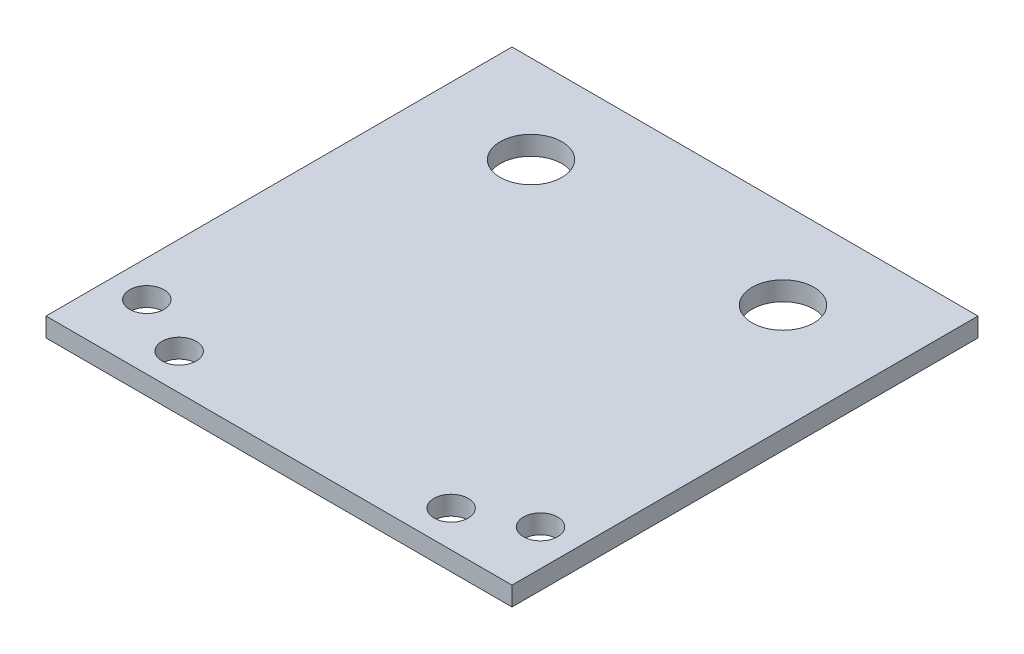
ISO-10303-21;
HEADER;
FILE_DESCRIPTION(('STEP AP214'),'2;1');
FILE_NAME('part.step','',(''),(''),'','','');
FILE_SCHEMA(('AUTOMOTIVE_DESIGN { 1 0 10303 214 1 1 1 1 }'));
ENDSEC;
DATA;
#1=APPLICATION_CONTEXT('core data for automotive mechanical design processes');
#2=APPLICATION_PROTOCOL_DEFINITION('international standard','automotive_design',2000,#1);
#3=PRODUCT_CONTEXT('',#1,'mechanical');
#4=PRODUCT('Part','Part','',(#3));
#5=PRODUCT_RELATED_PRODUCT_CATEGORY('part','',(#4));
#6=PRODUCT_DEFINITION_FORMATION('','',#4);
#7=PRODUCT_DEFINITION_CONTEXT('part definition',#1,'design');
#8=PRODUCT_DEFINITION('design','',#6,#7);
#9=PRODUCT_DEFINITION_SHAPE('','',#8);
#10=(LENGTH_UNIT() NAMED_UNIT(*) SI_UNIT(.MILLI.,.METRE.));
#11=(NAMED_UNIT(*) PLANE_ANGLE_UNIT() SI_UNIT($,.RADIAN.));
#12=(NAMED_UNIT(*) SI_UNIT($,.STERADIAN.) SOLID_ANGLE_UNIT());
#13=UNCERTAINTY_MEASURE_WITH_UNIT(LENGTH_MEASURE(1.E-05),#10,'distance_accuracy_value','');
#14=(GEOMETRIC_REPRESENTATION_CONTEXT(3) GLOBAL_UNCERTAINTY_ASSIGNED_CONTEXT((#13)) GLOBAL_UNIT_ASSIGNED_CONTEXT((#10,
#11,#12)) REPRESENTATION_CONTEXT('',''));
#15=CARTESIAN_POINT('',(0.,0.,0.));
#16=DIRECTION('',(0.,0.,1.));
#17=DIRECTION('',(1.,0.,0.));
#18=AXIS2_PLACEMENT_3D('',#15,#16,#17);
#19=CARTESIAN_POINT('',(0.,5.,0.));
#20=DIRECTION('',(0.,-1.,0.));
#21=DIRECTION('',(0.,0.,-1.));
#22=AXIS2_PLACEMENT_3D('',#19,#20,#21);
#23=PLANE('',#22);
#24=CARTESIAN_POINT('',(103.5,5.,88.5));
#25=DIRECTION('',(0.,1.,0.));
#26=DIRECTION('',(0.,0.,1.));
#27=AXIS2_PLACEMENT_3D('',#24,#25,#26);
#28=CIRCLE('',#27,8.99999999999999);
#29=CARTESIAN_POINT('',(103.5,5.,97.5));
#30=VERTEX_POINT('',#29);
#31=EDGE_CURVE('E167',#30,#30,#28,.T.);
#32=ORIENTED_EDGE('',*,*,#31,.F.);
#33=EDGE_LOOP('',(#32));
#34=FACE_BOUND('',#33,.T.);
#35=CARTESIAN_POINT('',(71.5,5.,103.5));
#36=DIRECTION('',(0.,1.,0.));
#37=DIRECTION('',(0.,0.,1.));
#38=AXIS2_PLACEMENT_3D('',#35,#36,#37);
#39=CIRCLE('',#38,9.00000000000001);
#40=CARTESIAN_POINT('',(71.5,5.,112.5));
#41=VERTEX_POINT('',#40);
#42=EDGE_CURVE('E159',#41,#41,#39,.T.);
#43=ORIENTED_EDGE('',*,*,#42,.F.);
#44=EDGE_LOOP('',(#43));
#45=FACE_BOUND('',#44,.T.);
#46=CARTESIAN_POINT('',(-71.5,5.,103.5));
#47=DIRECTION('',(0.,1.,0.));
#48=DIRECTION('',(0.,0.,-1.));
#49=AXIS2_PLACEMENT_3D('',#46,#47,#48);
#50=CIRCLE('',#49,9.00000000000001);
#51=CARTESIAN_POINT('',(-71.5,5.,94.5));
#52=VERTEX_POINT('',#51);
#53=EDGE_CURVE('E155',#52,#52,#50,.T.);
#54=ORIENTED_EDGE('',*,*,#53,.F.);
#55=EDGE_LOOP('',(#54));
#56=FACE_BOUND('',#55,.T.);
#57=CARTESIAN_POINT('',(-103.5,5.,88.5));
#58=DIRECTION('',(0.,1.,0.));
#59=DIRECTION('',(0.,0.,-1.));
#60=AXIS2_PLACEMENT_3D('',#57,#58,#59);
#61=CIRCLE('',#60,8.99999999999999);
#62=CARTESIAN_POINT('',(-103.5,5.,79.5));
#63=VERTEX_POINT('',#62);
#64=EDGE_CURVE('E146',#63,#63,#61,.T.);
#65=ORIENTED_EDGE('',*,*,#64,.F.);
#66=EDGE_LOOP('',(#65));
#67=FACE_BOUND('',#66,.T.);
#68=DIRECTION('',(-1.,0.,0.));
#69=VECTOR('',#68,1.);
#70=CARTESIAN_POINT('',(122.5,5.,-122.5));
#71=LINE('',#70,#69);
#72=CARTESIAN_POINT('',(122.5,5.,-122.5));
#73=VERTEX_POINT('',#72);
#74=CARTESIAN_POINT('',(-122.5,5.,-122.5));
#75=VERTEX_POINT('',#74);
#76=EDGE_CURVE('E92',#73,#75,#71,.T.);
#77=ORIENTED_EDGE('',*,*,#76,.T.);
#78=DIRECTION('',(0.,0.,1.));
#79=VECTOR('',#78,1.);
#80=CARTESIAN_POINT('',(-122.5,5.,122.5));
#81=LINE('',#80,#79);
#82=CARTESIAN_POINT('',(-122.5,5.,122.5));
#83=VERTEX_POINT('',#82);
#84=EDGE_CURVE('E87',#75,#83,#81,.T.);
#85=ORIENTED_EDGE('',*,*,#84,.T.);
#86=DIRECTION('',(1.,0.,0.));
#87=VECTOR('',#86,1.);
#88=CARTESIAN_POINT('',(-122.5,5.,122.5));
#89=LINE('',#88,#87);
#90=CARTESIAN_POINT('',(122.5,5.,122.5));
#91=VERTEX_POINT('',#90);
#92=EDGE_CURVE('E90',#83,#91,#89,.T.);
#93=ORIENTED_EDGE('',*,*,#92,.T.);
#94=DIRECTION('',(0.,0.,-1.));
#95=VECTOR('',#94,1.);
#96=CARTESIAN_POINT('',(122.5,5.,122.5));
#97=LINE('',#96,#95);
#98=EDGE_CURVE('E57',#91,#73,#97,.T.);
#99=ORIENTED_EDGE('',*,*,#98,.T.);
#100=EDGE_LOOP('',(#77,#85,#93,#99));
#101=FACE_BOUND('',#100,.T.);
#102=CARTESIAN_POINT('',(66.25,5.,-76.25));
#103=DIRECTION('',(0.,-1.,0.));
#104=DIRECTION('',(0.,0.,-1.));
#105=AXIS2_PLACEMENT_3D('',#102,#103,#104);
#106=CIRCLE('',#105,16.25);
#107=CARTESIAN_POINT('',(66.25,5.,-92.5000000000001));
#108=VERTEX_POINT('',#107);
#109=EDGE_CURVE('E135',#108,#108,#106,.T.);
#110=ORIENTED_EDGE('',*,*,#109,.T.);
#111=EDGE_LOOP('',(#110));
#112=FACE_BOUND('',#111,.T.);
#113=CARTESIAN_POINT('',(-66.25,5.,-76.25));
#114=DIRECTION('',(0.,1.,0.));
#115=DIRECTION('',(0.,0.,1.));
#116=AXIS2_PLACEMENT_3D('',#113,#114,#115);
#117=CIRCLE('',#116,16.25);
#118=CARTESIAN_POINT('',(-66.25,5.,-60.));
#119=VERTEX_POINT('',#118);
#120=EDGE_CURVE('E139',#119,#119,#117,.T.);
#121=ORIENTED_EDGE('',*,*,#120,.F.);
#122=EDGE_LOOP('',(#121));
#123=FACE_BOUND('',#122,.T.);
#124=ADVANCED_FACE('F38',(#34,#45,#56,#67,#101,#112,#123),#23,.F.);
#125=CARTESIAN_POINT('',(0.,-5.,0.));
#126=DIRECTION('',(0.,-1.,0.));
#127=DIRECTION('',(0.,0.,-1.));
#128=AXIS2_PLACEMENT_3D('',#125,#126,#127);
#129=PLANE('',#128);
#130=CARTESIAN_POINT('',(103.5,-5.,88.5));
#131=DIRECTION('',(0.,1.,0.));
#132=DIRECTION('',(0.,0.,1.));
#133=AXIS2_PLACEMENT_3D('',#130,#131,#132);
#134=CIRCLE('',#133,8.99999999999999);
#135=CARTESIAN_POINT('',(103.5,-5.,97.5));
#136=VERTEX_POINT('',#135);
#137=EDGE_CURVE('E166',#136,#136,#134,.T.);
#138=ORIENTED_EDGE('',*,*,#137,.T.);
#139=EDGE_LOOP('',(#138));
#140=FACE_BOUND('',#139,.T.);
#141=CARTESIAN_POINT('',(-71.5,-5.,103.5));
#142=DIRECTION('',(0.,1.,0.));
#143=DIRECTION('',(0.,0.,-1.));
#144=AXIS2_PLACEMENT_3D('',#141,#142,#143);
#145=CIRCLE('',#144,9.00000000000001);
#146=CARTESIAN_POINT('',(-71.5,-5.,94.5));
#147=VERTEX_POINT('',#146);
#148=EDGE_CURVE('E150',#147,#147,#145,.T.);
#149=ORIENTED_EDGE('',*,*,#148,.T.);
#150=EDGE_LOOP('',(#149));
#151=FACE_BOUND('',#150,.T.);
#152=CARTESIAN_POINT('',(-103.5,-5.,88.5));
#153=DIRECTION('',(0.,1.,0.));
#154=DIRECTION('',(0.,0.,-1.));
#155=AXIS2_PLACEMENT_3D('',#152,#153,#154);
#156=CIRCLE('',#155,8.99999999999999);
#157=CARTESIAN_POINT('',(-103.5,-5.,79.5));
#158=VERTEX_POINT('',#157);
#159=EDGE_CURVE('E151',#158,#158,#156,.T.);
#160=ORIENTED_EDGE('',*,*,#159,.T.);
#161=EDGE_LOOP('',(#160));
#162=FACE_BOUND('',#161,.T.);
#163=CARTESIAN_POINT('',(71.5,-5.,103.5));
#164=DIRECTION('',(0.,-1.,0.));
#165=DIRECTION('',(0.,0.,-1.));
#166=AXIS2_PLACEMENT_3D('',#163,#164,#165);
#167=CIRCLE('',#166,9.00000000000001);
#168=CARTESIAN_POINT('',(71.5,-5.,94.5));
#169=VERTEX_POINT('',#168);
#170=EDGE_CURVE('E42',#169,#169,#167,.T.);
#171=ORIENTED_EDGE('',*,*,#170,.F.);
#172=EDGE_LOOP('',(#171));
#173=FACE_BOUND('',#172,.T.);
#174=CARTESIAN_POINT('',(66.25,-5.,-76.25));
#175=DIRECTION('',(0.,-1.,0.));
#176=DIRECTION('',(0.,0.,-1.));
#177=AXIS2_PLACEMENT_3D('',#174,#175,#176);
#178=CIRCLE('',#177,16.25);
#179=CARTESIAN_POINT('',(66.25,-5.,-92.5000000000001));
#180=VERTEX_POINT('',#179);
#181=EDGE_CURVE('E131',#180,#180,#178,.T.);
#182=ORIENTED_EDGE('',*,*,#181,.F.);
#183=EDGE_LOOP('',(#182));
#184=FACE_BOUND('',#183,.T.);
#185=DIRECTION('',(-1.,0.,0.));
#186=VECTOR('',#185,1.);
#187=CARTESIAN_POINT('',(122.5,-5.,-122.5));
#188=LINE('',#187,#186);
#189=CARTESIAN_POINT('',(122.5,-5.,-122.5));
#190=VERTEX_POINT('',#189);
#191=CARTESIAN_POINT('',(-122.5,-5.,-122.5));
#192=VERTEX_POINT('',#191);
#193=EDGE_CURVE('E109',#190,#192,#188,.T.);
#194=ORIENTED_EDGE('',*,*,#193,.F.);
#195=DIRECTION('',(0.,0.,-1.));
#196=VECTOR('',#195,1.);
#197=CARTESIAN_POINT('',(122.5,-5.,122.5));
#198=LINE('',#197,#196);
#199=CARTESIAN_POINT('',(122.5,-5.,122.5));
#200=VERTEX_POINT('',#199);
#201=EDGE_CURVE('E80',#200,#190,#198,.T.);
#202=ORIENTED_EDGE('',*,*,#201,.F.);
#203=DIRECTION('',(1.,0.,0.));
#204=VECTOR('',#203,1.);
#205=CARTESIAN_POINT('',(-122.5,-5.,122.5));
#206=LINE('',#205,#204);
#207=CARTESIAN_POINT('',(-122.5,-5.,122.5));
#208=VERTEX_POINT('',#207);
#209=EDGE_CURVE('E74',#208,#200,#206,.T.);
#210=ORIENTED_EDGE('',*,*,#209,.F.);
#211=DIRECTION('',(0.,0.,1.));
#212=VECTOR('',#211,1.);
#213=CARTESIAN_POINT('',(-122.5,-5.,122.5));
#214=LINE('',#213,#212);
#215=EDGE_CURVE('E97',#192,#208,#214,.T.);
#216=ORIENTED_EDGE('',*,*,#215,.F.);
#217=EDGE_LOOP('',(#194,#202,#210,#216));
#218=FACE_BOUND('',#217,.T.);
#219=CARTESIAN_POINT('',(-66.25,-5.,-76.25));
#220=DIRECTION('',(0.,1.,0.));
#221=DIRECTION('',(0.,0.,1.));
#222=AXIS2_PLACEMENT_3D('',#219,#220,#221);
#223=CIRCLE('',#222,16.25);
#224=CARTESIAN_POINT('',(-66.25,-5.,-60.));
#225=VERTEX_POINT('',#224);
#226=EDGE_CURVE('E113',#225,#225,#223,.T.);
#227=ORIENTED_EDGE('',*,*,#226,.T.);
#228=EDGE_LOOP('',(#227));
#229=FACE_BOUND('',#228,.T.);
#230=ADVANCED_FACE('F126',(#140,#151,#162,#173,#184,#218,#229),#129,.T.);
#231=CARTESIAN_POINT('',(122.5,5.,-122.5));
#232=DIRECTION('',(0.,0.,1.));
#233=DIRECTION('',(1.,0.,0.));
#234=AXIS2_PLACEMENT_3D('',#231,#232,#233);
#235=PLANE('',#234);
#236=ORIENTED_EDGE('',*,*,#193,.T.);
#237=DIRECTION('',(0.,-1.,0.));
#238=VECTOR('',#237,1.);
#239=CARTESIAN_POINT('',(-122.5,5.,-122.5));
#240=LINE('',#239,#238);
#241=EDGE_CURVE('E11',#75,#192,#240,.T.);
#242=ORIENTED_EDGE('',*,*,#241,.F.);
#243=ORIENTED_EDGE('',*,*,#76,.F.);
#244=DIRECTION('',(0.,-1.,0.));
#245=VECTOR('',#244,1.);
#246=CARTESIAN_POINT('',(122.5,5.,-122.5));
#247=LINE('',#246,#245);
#248=EDGE_CURVE('E105',#73,#190,#247,.T.);
#249=ORIENTED_EDGE('',*,*,#248,.T.);
#250=EDGE_LOOP('',(#236,#242,#243,#249));
#251=FACE_BOUND('',#250,.T.);
#252=ADVANCED_FACE('F40',(#251),#235,.F.);
#253=CARTESIAN_POINT('',(-122.5,5.,122.5));
#254=DIRECTION('',(1.,0.,0.));
#255=DIRECTION('',(0.,0.,-1.));
#256=AXIS2_PLACEMENT_3D('',#253,#254,#255);
#257=PLANE('',#256);
#258=ORIENTED_EDGE('',*,*,#215,.T.);
#259=DIRECTION('',(0.,-1.,0.));
#260=VECTOR('',#259,1.);
#261=CARTESIAN_POINT('',(-122.5,5.,122.5));
#262=LINE('',#261,#260);
#263=EDGE_CURVE('E49',#83,#208,#262,.T.);
#264=ORIENTED_EDGE('',*,*,#263,.F.);
#265=ORIENTED_EDGE('',*,*,#84,.F.);
#266=ORIENTED_EDGE('',*,*,#241,.T.);
#267=EDGE_LOOP('',(#258,#264,#265,#266));
#268=FACE_BOUND('',#267,.T.);
#269=ADVANCED_FACE('F96',(#268),#257,.F.);
#270=CARTESIAN_POINT('',(-122.5,5.,122.5));
#271=DIRECTION('',(0.,0.,-1.));
#272=DIRECTION('',(-1.,0.,0.));
#273=AXIS2_PLACEMENT_3D('',#270,#271,#272);
#274=PLANE('',#273);
#275=ORIENTED_EDGE('',*,*,#209,.T.);
#276=DIRECTION('',(0.,-1.,0.));
#277=VECTOR('',#276,1.);
#278=CARTESIAN_POINT('',(122.5,5.,122.5));
#279=LINE('',#278,#277);
#280=EDGE_CURVE('E99',#91,#200,#279,.T.);
#281=ORIENTED_EDGE('',*,*,#280,.F.);
#282=ORIENTED_EDGE('',*,*,#92,.F.);
#283=ORIENTED_EDGE('',*,*,#263,.T.);
#284=EDGE_LOOP('',(#275,#281,#282,#283));
#285=FACE_BOUND('',#284,.T.);
#286=ADVANCED_FACE('F101',(#285),#274,.F.);
#287=CARTESIAN_POINT('',(122.5,5.,122.5));
#288=DIRECTION('',(-1.,0.,0.));
#289=DIRECTION('',(0.,0.,1.));
#290=AXIS2_PLACEMENT_3D('',#287,#288,#289);
#291=PLANE('',#290);
#292=ORIENTED_EDGE('',*,*,#201,.T.);
#293=ORIENTED_EDGE('',*,*,#248,.F.);
#294=ORIENTED_EDGE('',*,*,#98,.F.);
#295=ORIENTED_EDGE('',*,*,#280,.T.);
#296=EDGE_LOOP('',(#292,#293,#294,#295));
#297=FACE_BOUND('',#296,.T.);
#298=ADVANCED_FACE('F123',(#297),#291,.F.);
#299=CARTESIAN_POINT('',(66.25,-5.,-76.25));
#300=DIRECTION('',(0.,1.,0.));
#301=DIRECTION('',(0.,0.,1.));
#302=AXIS2_PLACEMENT_3D('',#299,#300,#301);
#303=CYLINDRICAL_SURFACE('',#302,16.25);
#304=ORIENTED_EDGE('',*,*,#181,.T.);
#305=EDGE_LOOP('',(#304));
#306=FACE_BOUND('',#305,.T.);
#307=ORIENTED_EDGE('',*,*,#109,.F.);
#308=EDGE_LOOP('',(#307));
#309=FACE_BOUND('',#308,.T.);
#310=ADVANCED_FACE('F199',(#306,#309),#303,.F.);
#311=CARTESIAN_POINT('',(-66.25,-5.,-76.25));
#312=DIRECTION('',(0.,1.,0.));
#313=DIRECTION('',(0.,0.,1.));
#314=AXIS2_PLACEMENT_3D('',#311,#312,#313);
#315=CYLINDRICAL_SURFACE('',#314,16.25);
#316=ORIENTED_EDGE('',*,*,#226,.F.);
#317=EDGE_LOOP('',(#316));
#318=FACE_BOUND('',#317,.T.);
#319=ORIENTED_EDGE('',*,*,#120,.T.);
#320=EDGE_LOOP('',(#319));
#321=FACE_BOUND('',#320,.T.);
#322=ADVANCED_FACE('F237',(#318,#321),#315,.F.);
#323=CARTESIAN_POINT('',(71.5,-10.,103.5));
#324=DIRECTION('',(0.,1.,0.));
#325=DIRECTION('',(0.,0.,1.));
#326=AXIS2_PLACEMENT_3D('',#323,#324,#325);
#327=CYLINDRICAL_SURFACE('',#326,9.00000000000001);
#328=ORIENTED_EDGE('',*,*,#170,.T.);
#329=EDGE_LOOP('',(#328));
#330=FACE_BOUND('',#329,.T.);
#331=ORIENTED_EDGE('',*,*,#42,.T.);
#332=EDGE_LOOP('',(#331));
#333=FACE_BOUND('',#332,.T.);
#334=ADVANCED_FACE('F246',(#330,#333),#327,.F.);
#335=CARTESIAN_POINT('',(-103.5,5.,88.5));
#336=DIRECTION('',(0.,-1.,0.));
#337=DIRECTION('',(0.,0.,-1.));
#338=AXIS2_PLACEMENT_3D('',#335,#336,#337);
#339=CYLINDRICAL_SURFACE('',#338,8.99999999999999);
#340=ORIENTED_EDGE('',*,*,#64,.T.);
#341=EDGE_LOOP('',(#340));
#342=FACE_BOUND('',#341,.T.);
#343=ORIENTED_EDGE('',*,*,#159,.F.);
#344=EDGE_LOOP('',(#343));
#345=FACE_BOUND('',#344,.T.);
#346=ADVANCED_FACE('F185',(#342,#345),#339,.F.);
#347=CARTESIAN_POINT('',(-71.5,5.,103.5));
#348=DIRECTION('',(0.,-1.,0.));
#349=DIRECTION('',(0.,0.,-1.));
#350=AXIS2_PLACEMENT_3D('',#347,#348,#349);
#351=CYLINDRICAL_SURFACE('',#350,9.00000000000001);
#352=ORIENTED_EDGE('',*,*,#53,.T.);
#353=EDGE_LOOP('',(#352));
#354=FACE_BOUND('',#353,.T.);
#355=ORIENTED_EDGE('',*,*,#148,.F.);
#356=EDGE_LOOP('',(#355));
#357=FACE_BOUND('',#356,.T.);
#358=ADVANCED_FACE('F179',(#354,#357),#351,.F.);
#359=CARTESIAN_POINT('',(103.5,5.,88.5));
#360=DIRECTION('',(0.,-1.,0.));
#361=DIRECTION('',(0.,0.,-1.));
#362=AXIS2_PLACEMENT_3D('',#359,#360,#361);
#363=CYLINDRICAL_SURFACE('',#362,8.99999999999999);
#364=ORIENTED_EDGE('',*,*,#31,.T.);
#365=EDGE_LOOP('',(#364));
#366=FACE_BOUND('',#365,.T.);
#367=ORIENTED_EDGE('',*,*,#137,.F.);
#368=EDGE_LOOP('',(#367));
#369=FACE_BOUND('',#368,.T.);
#370=ADVANCED_FACE('F177',(#366,#369),#363,.F.);
#371=CLOSED_SHELL('',(#124,#230,#252,#269,#286,#298,#310,#322,#334,#346,#358,#370));
#372=MANIFOLD_SOLID_BREP('B2',#371);
#373=ADVANCED_BREP_SHAPE_REPRESENTATION('',(#18,#372),#14);
#374=SHAPE_DEFINITION_REPRESENTATION(#9,#373);
ENDSEC;
END-ISO-10303-21;
